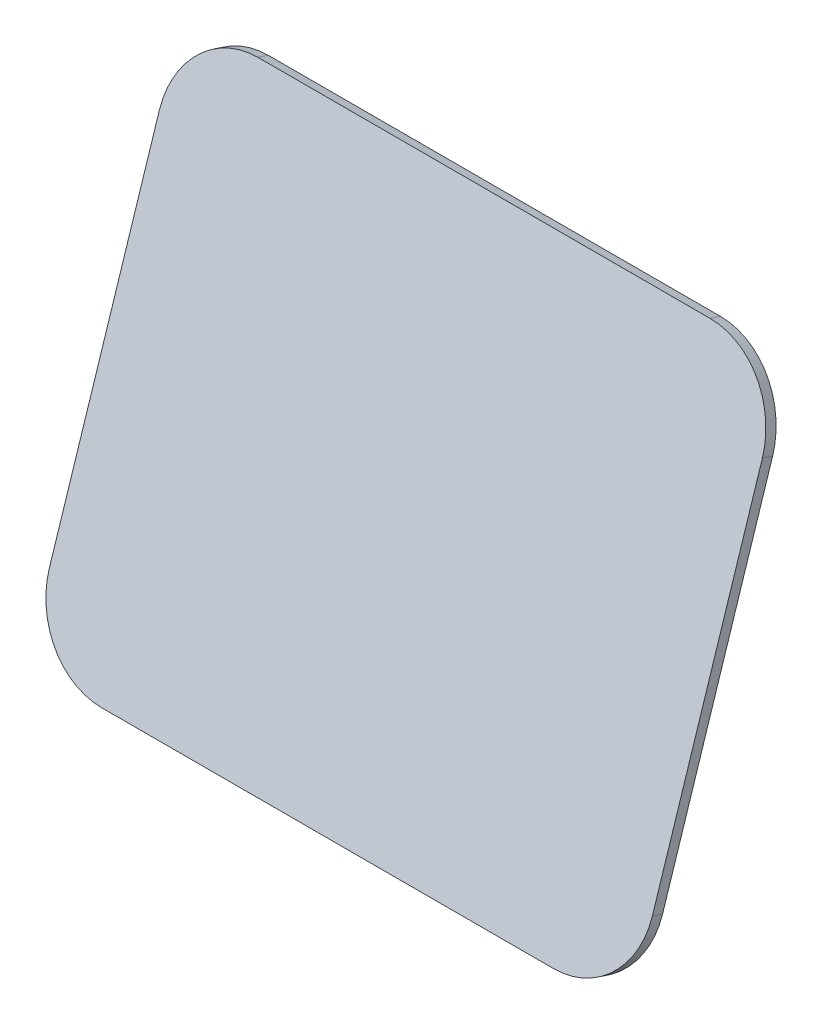
ISO-10303-21;
HEADER;
FILE_DESCRIPTION(('STEP AP214'),'2;1');
FILE_NAME('part.step','',(''),(''),'','','');
FILE_SCHEMA(('AUTOMOTIVE_DESIGN { 1 0 10303 214 1 1 1 1 }'));
ENDSEC;
DATA;
#1=APPLICATION_CONTEXT('core data for automotive mechanical design processes');
#2=APPLICATION_PROTOCOL_DEFINITION('international standard','automotive_design',2000,#1);
#3=PRODUCT_CONTEXT('',#1,'mechanical');
#4=PRODUCT('Part','Part','',(#3));
#5=PRODUCT_RELATED_PRODUCT_CATEGORY('part','',(#4));
#6=PRODUCT_DEFINITION_FORMATION('','',#4);
#7=PRODUCT_DEFINITION_CONTEXT('part definition',#1,'design');
#8=PRODUCT_DEFINITION('design','',#6,#7);
#9=PRODUCT_DEFINITION_SHAPE('','',#8);
#10=(LENGTH_UNIT() NAMED_UNIT(*) SI_UNIT(.MILLI.,.METRE.));
#11=(NAMED_UNIT(*) PLANE_ANGLE_UNIT() SI_UNIT($,.RADIAN.));
#12=(NAMED_UNIT(*) SI_UNIT($,.STERADIAN.) SOLID_ANGLE_UNIT());
#13=UNCERTAINTY_MEASURE_WITH_UNIT(LENGTH_MEASURE(1.E-05),#10,'distance_accuracy_value','');
#14=(GEOMETRIC_REPRESENTATION_CONTEXT(3) GLOBAL_UNCERTAINTY_ASSIGNED_CONTEXT((#13)) GLOBAL_UNIT_ASSIGNED_CONTEXT((#10,
#11,#12)) REPRESENTATION_CONTEXT('',''));
#15=CARTESIAN_POINT('',(0.,0.,0.));
#16=DIRECTION('',(0.,0.,1.));
#17=DIRECTION('',(1.,0.,0.));
#18=AXIS2_PLACEMENT_3D('',#15,#16,#17);
#19=CARTESIAN_POINT('',(63.,78.5707324184173,211.715325953901));
#20=DIRECTION('',(0.,-0.30660913934042,-0.951835508726653));
#21=DIRECTION('',(0.,0.951835508726653,-0.30660913934042));
#22=AXIS2_PLACEMENT_3D('',#19,#20,#21);
#23=CYLINDRICAL_SURFACE('',#22,21.);
#24=CARTESIAN_POINT('',(63.,77.6509050003961,208.859819427721));
#25=DIRECTION('',(0.,0.30660913934042,0.951835508726653));
#26=DIRECTION('',(0.,0.951835508726653,-0.30660913934042));
#27=AXIS2_PLACEMENT_3D('',#24,#25,#26);
#28=CIRCLE('',#27,21.);
#29=CARTESIAN_POINT('',(62.9999999999999,57.6623593171363,215.29861135387));
#30=VERTEX_POINT('',#29);
#31=CARTESIAN_POINT('',(84.,77.6509050003962,208.859819427721));
#32=VERTEX_POINT('',#31);
#33=EDGE_CURVE('E182',#30,#32,#28,.T.);
#34=ORIENTED_EDGE('',*,*,#33,.T.);
#35=DIRECTION('',(0.,-0.30660913934042,-0.951835508726653));
#36=VECTOR('',#35,1.);
#37=CARTESIAN_POINT('',(84.,78.5707324184175,211.715325953901));
#38=LINE('',#37,#36);
#39=CARTESIAN_POINT('',(84.,78.5707324184175,211.715325953901));
#40=VERTEX_POINT('',#39);
#41=EDGE_CURVE('E12',#40,#32,#38,.T.);
#42=ORIENTED_EDGE('',*,*,#41,.F.);
#43=CARTESIAN_POINT('',(63.,78.5707324184173,211.715325953901));
#44=DIRECTION('',(0.,0.30660913934042,0.951835508726653));
#45=DIRECTION('',(0.,0.951835508726653,-0.30660913934042));
#46=AXIS2_PLACEMENT_3D('',#43,#44,#45);
#47=CIRCLE('',#46,21.);
#48=CARTESIAN_POINT('',(62.9999999999999,58.5821867351576,218.15411788005));
#49=VERTEX_POINT('',#48);
#50=EDGE_CURVE('E149',#49,#40,#47,.T.);
#51=ORIENTED_EDGE('',*,*,#50,.F.);
#52=DIRECTION('',(0.,-0.30660913934042,-0.951835508726653));
#53=VECTOR('',#52,1.);
#54=CARTESIAN_POINT('',(62.9999999999999,58.5821867351576,218.15411788005));
#55=LINE('',#54,#53);
#56=EDGE_CURVE('E127',#49,#30,#55,.T.);
#57=ORIENTED_EDGE('',*,*,#56,.T.);
#58=EDGE_LOOP('',(#34,#42,#51,#57));
#59=FACE_BOUND('',#58,.T.);
#60=ADVANCED_FACE('F35',(#59),#23,.T.);
#61=CARTESIAN_POINT('',(84.,173.754283291082,181.054412019859));
#62=DIRECTION('',(-1.,0.,0.));
#63=DIRECTION('',(0.,-1.,0.));
#64=AXIS2_PLACEMENT_3D('',#61,#62,#63);
#65=PLANE('',#64);
#66=DIRECTION('',(0.,0.951835508726653,-0.306609139340421));
#67=VECTOR('',#66,1.);
#68=CARTESIAN_POINT('',(84.,172.834455873061,178.198905493679));
#69=LINE('',#68,#67);
#70=CARTESIAN_POINT('',(84.,172.834455873061,178.198905493679));
#71=VERTEX_POINT('',#70);
#72=EDGE_CURVE('E176',#32,#71,#69,.T.);
#73=ORIENTED_EDGE('',*,*,#72,.T.);
#74=DIRECTION('',(0.,-0.30660913934042,-0.951835508726653));
#75=VECTOR('',#74,1.);
#76=CARTESIAN_POINT('',(84.,173.754283291082,181.054412019859));
#77=LINE('',#76,#75);
#78=CARTESIAN_POINT('',(84.,173.754283291082,181.054412019859));
#79=VERTEX_POINT('',#78);
#80=EDGE_CURVE('E43',#79,#71,#77,.T.);
#81=ORIENTED_EDGE('',*,*,#80,.F.);
#82=DIRECTION('',(0.,0.951835508726653,-0.306609139340421));
#83=VECTOR('',#82,1.);
#84=CARTESIAN_POINT('',(84.,173.754283291082,181.054412019859));
#85=LINE('',#84,#83);
#86=EDGE_CURVE('E94',#40,#79,#85,.T.);
#87=ORIENTED_EDGE('',*,*,#86,.F.);
#88=ORIENTED_EDGE('',*,*,#41,.T.);
#89=EDGE_LOOP('',(#73,#81,#87,#88));
#90=FACE_BOUND('',#89,.T.);
#91=ADVANCED_FACE('F201',(#90),#65,.F.);
#92=CARTESIAN_POINT('',(63.,173.754283291083,181.054412019859));
#93=DIRECTION('',(0.,-0.30660913934042,-0.951835508726653));
#94=DIRECTION('',(0.,0.951835508726653,-0.30660913934042));
#95=AXIS2_PLACEMENT_3D('',#92,#93,#94);
#96=CYLINDRICAL_SURFACE('',#95,21.);
#97=CARTESIAN_POINT('',(63.,172.834455873061,178.198905493679));
#98=DIRECTION('',(0.,0.30660913934042,0.951835508726653));
#99=DIRECTION('',(0.,-0.951835508726653,0.30660913934042));
#100=AXIS2_PLACEMENT_3D('',#97,#98,#99);
#101=CIRCLE('',#100,21.);
#102=CARTESIAN_POINT('',(62.9999999999998,192.823001556321,171.76011356753));
#103=VERTEX_POINT('',#102);
#104=EDGE_CURVE('E171',#71,#103,#101,.T.);
#105=ORIENTED_EDGE('',*,*,#104,.T.);
#106=DIRECTION('',(0.,-0.30660913934042,-0.951835508726653));
#107=VECTOR('',#106,1.);
#108=CARTESIAN_POINT('',(62.9999999999998,193.742828974342,174.61562009371));
#109=LINE('',#108,#107);
#110=CARTESIAN_POINT('',(62.9999999999998,193.742828974342,174.61562009371));
#111=VERTEX_POINT('',#110);
#112=EDGE_CURVE('E163',#111,#103,#109,.T.);
#113=ORIENTED_EDGE('',*,*,#112,.F.);
#114=CARTESIAN_POINT('',(63.,173.754283291083,181.054412019859));
#115=DIRECTION('',(0.,0.30660913934042,0.951835508726653));
#116=DIRECTION('',(0.,-0.951835508726653,0.30660913934042));
#117=AXIS2_PLACEMENT_3D('',#114,#115,#116);
#118=CIRCLE('',#117,21.);
#119=EDGE_CURVE('E142',#79,#111,#118,.T.);
#120=ORIENTED_EDGE('',*,*,#119,.F.);
#121=ORIENTED_EDGE('',*,*,#80,.T.);
#122=EDGE_LOOP('',(#105,#113,#120,#121));
#123=FACE_BOUND('',#122,.T.);
#124=ADVANCED_FACE('F169',(#123),#96,.T.);
#125=CARTESIAN_POINT('',(-62.9999999999998,193.742828974342,174.61562009371));
#126=DIRECTION('',(0.,-0.951835508726653,0.30660913934042));
#127=DIRECTION('',(0.,-0.30660913934042,-0.951835508726653));
#128=AXIS2_PLACEMENT_3D('',#125,#126,#127);
#129=PLANE('',#128);
#130=DIRECTION('',(-1.,0.,0.));
#131=VECTOR('',#130,1.);
#132=CARTESIAN_POINT('',(-62.9999999999998,192.823001556321,171.76011356753));
#133=LINE('',#132,#131);
#134=CARTESIAN_POINT('',(-62.9999999999998,192.823001556321,171.76011356753));
#135=VERTEX_POINT('',#134);
#136=EDGE_CURVE('E178',#103,#135,#133,.T.);
#137=ORIENTED_EDGE('',*,*,#136,.T.);
#138=DIRECTION('',(0.,-0.30660913934042,-0.951835508726653));
#139=VECTOR('',#138,1.);
#140=CARTESIAN_POINT('',(-62.9999999999998,193.742828974342,174.61562009371));
#141=LINE('',#140,#139);
#142=CARTESIAN_POINT('',(-62.9999999999998,193.742828974342,174.61562009371));
#143=VERTEX_POINT('',#142);
#144=EDGE_CURVE('E160',#143,#135,#141,.T.);
#145=ORIENTED_EDGE('',*,*,#144,.F.);
#146=DIRECTION('',(-1.,0.,0.));
#147=VECTOR('',#146,1.);
#148=CARTESIAN_POINT('',(-62.9999999999998,193.742828974342,174.61562009371));
#149=LINE('',#148,#147);
#150=EDGE_CURVE('E139',#111,#143,#149,.T.);
#151=ORIENTED_EDGE('',*,*,#150,.F.);
#152=ORIENTED_EDGE('',*,*,#112,.T.);
#153=EDGE_LOOP('',(#137,#145,#151,#152));
#154=FACE_BOUND('',#153,.T.);
#155=ADVANCED_FACE('F208',(#154),#129,.F.);
#156=CARTESIAN_POINT('',(-63.,173.754283291083,181.054412019859));
#157=DIRECTION('',(0.,-0.30660913934042,-0.951835508726653));
#158=DIRECTION('',(0.,0.951835508726653,-0.30660913934042));
#159=AXIS2_PLACEMENT_3D('',#156,#157,#158);
#160=CYLINDRICAL_SURFACE('',#159,21.);
#161=CARTESIAN_POINT('',(-63.,172.834455873061,178.198905493679));
#162=DIRECTION('',(0.,0.30660913934042,0.951835508726653));
#163=DIRECTION('',(0.,0.951835508726653,-0.30660913934042));
#164=AXIS2_PLACEMENT_3D('',#161,#162,#163);
#165=CIRCLE('',#164,21.);
#166=CARTESIAN_POINT('',(-84.,172.834455873061,178.198905493679));
#167=VERTEX_POINT('',#166);
#168=EDGE_CURVE('E180',#135,#167,#165,.T.);
#169=ORIENTED_EDGE('',*,*,#168,.T.);
#170=DIRECTION('',(0.,-0.30660913934042,-0.951835508726653));
#171=VECTOR('',#170,1.);
#172=CARTESIAN_POINT('',(-84.,173.754283291083,181.054412019859));
#173=LINE('',#172,#171);
#174=CARTESIAN_POINT('',(-84.,173.754283291083,181.054412019859));
#175=VERTEX_POINT('',#174);
#176=EDGE_CURVE('E122',#175,#167,#173,.T.);
#177=ORIENTED_EDGE('',*,*,#176,.F.);
#178=CARTESIAN_POINT('',(-63.,173.754283291083,181.054412019859));
#179=DIRECTION('',(0.,0.30660913934042,0.951835508726653));
#180=DIRECTION('',(0.,0.951835508726653,-0.30660913934042));
#181=AXIS2_PLACEMENT_3D('',#178,#179,#180);
#182=CIRCLE('',#181,21.);
#183=EDGE_CURVE('E113',#143,#175,#182,.T.);
#184=ORIENTED_EDGE('',*,*,#183,.F.);
#185=ORIENTED_EDGE('',*,*,#144,.T.);
#186=EDGE_LOOP('',(#169,#177,#184,#185));
#187=FACE_BOUND('',#186,.T.);
#188=ADVANCED_FACE('F186',(#187),#160,.T.);
#189=CARTESIAN_POINT('',(-84.,78.5707324184174,211.715325953901));
#190=DIRECTION('',(1.,0.,0.));
#191=DIRECTION('',(0.,0.,-1.));
#192=AXIS2_PLACEMENT_3D('',#189,#190,#191);
#193=PLANE('',#192);
#194=DIRECTION('',(0.,-0.951835508726653,0.306609139340421));
#195=VECTOR('',#194,1.);
#196=CARTESIAN_POINT('',(-84.,77.6509050003962,208.859819427721));
#197=LINE('',#196,#195);
#198=CARTESIAN_POINT('',(-84.,77.6509050003962,208.859819427721));
#199=VERTEX_POINT('',#198);
#200=EDGE_CURVE('E121',#167,#199,#197,.T.);
#201=ORIENTED_EDGE('',*,*,#200,.T.);
#202=DIRECTION('',(0.,-0.30660913934042,-0.951835508726653));
#203=VECTOR('',#202,1.);
#204=CARTESIAN_POINT('',(-84.,78.5707324184174,211.715325953901));
#205=LINE('',#204,#203);
#206=CARTESIAN_POINT('',(-84.,78.5707324184174,211.715325953901));
#207=VERTEX_POINT('',#206);
#208=EDGE_CURVE('E118',#207,#199,#205,.T.);
#209=ORIENTED_EDGE('',*,*,#208,.F.);
#210=DIRECTION('',(0.,-0.951835508726653,0.306609139340421));
#211=VECTOR('',#210,1.);
#212=CARTESIAN_POINT('',(-84.,78.5707324184174,211.715325953901));
#213=LINE('',#212,#211);
#214=EDGE_CURVE('E107',#175,#207,#213,.T.);
#215=ORIENTED_EDGE('',*,*,#214,.F.);
#216=ORIENTED_EDGE('',*,*,#176,.T.);
#217=EDGE_LOOP('',(#201,#209,#215,#216));
#218=FACE_BOUND('',#217,.T.);
#219=ADVANCED_FACE('F119',(#218),#193,.F.);
#220=CARTESIAN_POINT('',(-63.,78.5707324184173,211.715325953901));
#221=DIRECTION('',(0.,-0.30660913934042,-0.951835508726653));
#222=DIRECTION('',(0.,0.951835508726653,-0.30660913934042));
#223=AXIS2_PLACEMENT_3D('',#220,#221,#222);
#224=CYLINDRICAL_SURFACE('',#223,21.);
#225=CARTESIAN_POINT('',(-63.,77.6509050003961,208.859819427721));
#226=DIRECTION('',(0.,0.30660913934042,0.951835508726653));
#227=DIRECTION('',(0.,0.951835508726653,-0.30660913934042));
#228=AXIS2_PLACEMENT_3D('',#225,#226,#227);
#229=CIRCLE('',#228,21.);
#230=CARTESIAN_POINT('',(-62.9999999999998,57.6623593171363,215.29861135387));
#231=VERTEX_POINT('',#230);
#232=EDGE_CURVE('E80',#199,#231,#229,.T.);
#233=ORIENTED_EDGE('',*,*,#232,.T.);
#234=DIRECTION('',(0.,-0.30660913934042,-0.951835508726653));
#235=VECTOR('',#234,1.);
#236=CARTESIAN_POINT('',(-62.9999999999998,58.5821867351576,218.15411788005));
#237=LINE('',#236,#235);
#238=CARTESIAN_POINT('',(-62.9999999999998,58.5821867351576,218.15411788005));
#239=VERTEX_POINT('',#238);
#240=EDGE_CURVE('E123',#239,#231,#237,.T.);
#241=ORIENTED_EDGE('',*,*,#240,.F.);
#242=CARTESIAN_POINT('',(-63.,78.5707324184173,211.715325953901));
#243=DIRECTION('',(0.,0.30660913934042,0.951835508726653));
#244=DIRECTION('',(0.,0.951835508726653,-0.30660913934042));
#245=AXIS2_PLACEMENT_3D('',#242,#243,#244);
#246=CIRCLE('',#245,21.);
#247=EDGE_CURVE('E111',#207,#239,#246,.T.);
#248=ORIENTED_EDGE('',*,*,#247,.F.);
#249=ORIENTED_EDGE('',*,*,#208,.T.);
#250=EDGE_LOOP('',(#233,#241,#248,#249));
#251=FACE_BOUND('',#250,.T.);
#252=ADVANCED_FACE('F125',(#251),#224,.T.);
#253=CARTESIAN_POINT('',(62.9999999999999,58.5821867351576,218.15411788005));
#254=DIRECTION('',(0.,0.951835508726653,-0.30660913934042));
#255=DIRECTION('',(0.,0.30660913934042,0.951835508726653));
#256=AXIS2_PLACEMENT_3D('',#253,#254,#255);
#257=PLANE('',#256);
#258=DIRECTION('',(1.,0.,0.));
#259=VECTOR('',#258,1.);
#260=CARTESIAN_POINT('',(62.9999999999999,57.6623593171363,215.29861135387));
#261=LINE('',#260,#259);
#262=EDGE_CURVE('E86',#231,#30,#261,.T.);
#263=ORIENTED_EDGE('',*,*,#262,.T.);
#264=ORIENTED_EDGE('',*,*,#56,.F.);
#265=DIRECTION('',(1.,0.,0.));
#266=VECTOR('',#265,1.);
#267=CARTESIAN_POINT('',(62.9999999999999,58.5821867351576,218.15411788005));
#268=LINE('',#267,#266);
#269=EDGE_CURVE('E51',#239,#49,#268,.T.);
#270=ORIENTED_EDGE('',*,*,#269,.F.);
#271=ORIENTED_EDGE('',*,*,#240,.T.);
#272=EDGE_LOOP('',(#263,#264,#270,#271));
#273=FACE_BOUND('',#272,.T.);
#274=ADVANCED_FACE('F190',(#273),#257,.F.);
#275=CARTESIAN_POINT('',(63.,78.5707324184173,211.715325953901));
#276=DIRECTION('',(0.,-0.30660913934042,-0.951835508726653));
#277=DIRECTION('',(0.,0.951835508726653,-0.30660913934042));
#278=AXIS2_PLACEMENT_3D('',#275,#276,#277);
#279=PLANE('',#278);
#280=ORIENTED_EDGE('',*,*,#50,.T.);
#281=ORIENTED_EDGE('',*,*,#86,.T.);
#282=ORIENTED_EDGE('',*,*,#119,.T.);
#283=ORIENTED_EDGE('',*,*,#150,.T.);
#284=ORIENTED_EDGE('',*,*,#183,.T.);
#285=ORIENTED_EDGE('',*,*,#214,.T.);
#286=ORIENTED_EDGE('',*,*,#247,.T.);
#287=ORIENTED_EDGE('',*,*,#269,.T.);
#288=EDGE_LOOP('',(#280,#281,#282,#283,#284,#285,#286,#287));
#289=FACE_BOUND('',#288,.T.);
#290=ADVANCED_FACE('F109',(#289),#279,.F.);
#291=CARTESIAN_POINT('',(63.,77.6509050003961,208.859819427721));
#292=DIRECTION('',(0.,-0.30660913934042,-0.951835508726653));
#293=DIRECTION('',(0.,0.951835508726653,-0.30660913934042));
#294=AXIS2_PLACEMENT_3D('',#291,#292,#293);
#295=PLANE('',#294);
#296=ORIENTED_EDGE('',*,*,#33,.F.);
#297=ORIENTED_EDGE('',*,*,#262,.F.);
#298=ORIENTED_EDGE('',*,*,#232,.F.);
#299=ORIENTED_EDGE('',*,*,#200,.F.);
#300=ORIENTED_EDGE('',*,*,#168,.F.);
#301=ORIENTED_EDGE('',*,*,#136,.F.);
#302=ORIENTED_EDGE('',*,*,#104,.F.);
#303=ORIENTED_EDGE('',*,*,#72,.F.);
#304=EDGE_LOOP('',(#296,#297,#298,#299,#300,#301,#302,#303));
#305=FACE_BOUND('',#304,.T.);
#306=ADVANCED_FACE('F175',(#305),#295,.T.);
#307=CLOSED_SHELL('',(#60,#91,#124,#155,#188,#219,#252,#274,#290,#306));
#308=MANIFOLD_SOLID_BREP('B2',#307);
#309=ADVANCED_BREP_SHAPE_REPRESENTATION('',(#18,#308),#14);
#310=SHAPE_DEFINITION_REPRESENTATION(#9,#309);
ENDSEC;
END-ISO-10303-21;
